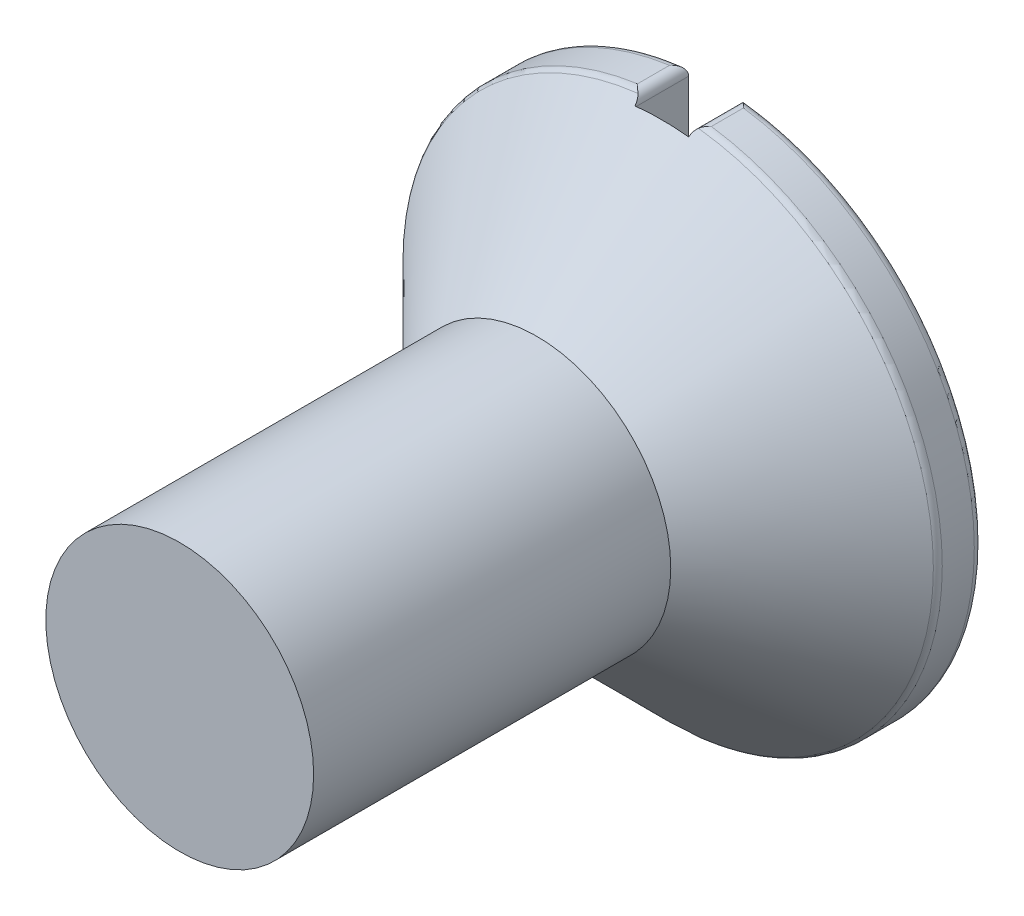
ISO-10303-21;
HEADER;
FILE_DESCRIPTION(('STEP AP214'),'2;1');
FILE_NAME('part.step','',(''),(''),'','','');
FILE_SCHEMA(('AUTOMOTIVE_DESIGN { 1 0 10303 214 1 1 1 1 }'));
ENDSEC;
DATA;
#1=APPLICATION_CONTEXT('core data for automotive mechanical design processes');
#2=APPLICATION_PROTOCOL_DEFINITION('international standard','automotive_design',2000,#1);
#3=PRODUCT_CONTEXT('',#1,'mechanical');
#4=PRODUCT('Part','Part','',(#3));
#5=PRODUCT_RELATED_PRODUCT_CATEGORY('part','',(#4));
#6=PRODUCT_DEFINITION_FORMATION('','',#4);
#7=PRODUCT_DEFINITION_CONTEXT('part definition',#1,'design');
#8=PRODUCT_DEFINITION('design','',#6,#7);
#9=PRODUCT_DEFINITION_SHAPE('','',#8);
#10=(LENGTH_UNIT() NAMED_UNIT(*) SI_UNIT(.MILLI.,.METRE.));
#11=(NAMED_UNIT(*) PLANE_ANGLE_UNIT() SI_UNIT($,.RADIAN.));
#12=(NAMED_UNIT(*) SI_UNIT($,.STERADIAN.) SOLID_ANGLE_UNIT());
#13=UNCERTAINTY_MEASURE_WITH_UNIT(LENGTH_MEASURE(1.E-05),#10,'distance_accuracy_value','');
#14=(GEOMETRIC_REPRESENTATION_CONTEXT(3) GLOBAL_UNCERTAINTY_ASSIGNED_CONTEXT((#13)) GLOBAL_UNIT_ASSIGNED_CONTEXT((#10,
#11,#12)) REPRESENTATION_CONTEXT('',''));
#15=CARTESIAN_POINT('',(0.,0.,0.));
#16=DIRECTION('',(0.,0.,1.));
#17=DIRECTION('',(1.,0.,0.));
#18=AXIS2_PLACEMENT_3D('',#15,#16,#17);
#19=CARTESIAN_POINT('',(0.,0.,0.));
#20=DIRECTION('',(0.,0.,-1.));
#21=DIRECTION('',(1.,0.,0.));
#22=AXIS2_PLACEMENT_3D('',#19,#20,#21);
#23=CONICAL_SURFACE('',#22,3.,0.78539816339745);
#24=CARTESIAN_POINT('',(0.,0.,0.0999999999999999));
#25=DIRECTION('',(0.,0.,-1.));
#26=DIRECTION('',(-1.,0.,0.));
#27=AXIS2_PLACEMENT_3D('',#24,#25,#26);
#28=CIRCLE('',#27,2.9);
#29=CARTESIAN_POINT('',(0.30073272659733,-2.8843647181231,0.0999999999999999));
#30=VERTEX_POINT('',#29);
#31=CARTESIAN_POINT('',(-0.300732726597331,-2.8843647181231,0.0999999999999999));
#32=VERTEX_POINT('',#31);
#33=EDGE_CURVE('E171',#30,#32,#28,.T.);
#34=ORIENTED_EDGE('',*,*,#33,.F.);
#35=CARTESIAN_POINT('',(0.30073272659733,-2.8843647181231,0.0999999999999999));
#36=CARTESIAN_POINT('',(0.301684783711957,-2.89206566258414,0.0922398695165193));
#37=CARTESIAN_POINT('',(0.303512139332086,-2.89969777176443,0.0844612827452677));
#38=CARTESIAN_POINT('',(0.308930839126989,-2.91430810945922,0.0693646726154849));
#39=CARTESIAN_POINT('',(0.312470438348838,-2.92129877286982,0.0620398414766648));
#40=CARTESIAN_POINT('',(0.319753628382327,-2.9321667859567,0.0504510048082696));
#41=CARTESIAN_POINT('',(0.322954779256334,-2.93625171193263,0.0460427199072146));
#42=CARTESIAN_POINT('',(0.330203894200469,-2.94409616155038,0.037445860466726));
#43=CARTESIAN_POINT('',(0.334266512358851,-2.94784821238044,0.0332629033433334));
#44=CARTESIAN_POINT('',(0.338755932738863,-2.95133297869326,0.0292893218813455));
#45=B_SPLINE_CURVE_WITH_KNOTS('',3,(#35,#36,#37,#38,#39,#40,#41,#42,#43,#44),.UNSPECIFIED.,.F.,
.F.,(4,2,2,2,4),(0.,0.0329529666263732,0.0649670028495592,0.0853370941347106,0.106086372365886),.UNSPECIFIED.);
#46=CARTESIAN_POINT('',(0.338755932738863,-2.95133297869326,0.0292893218813454));
#47=VERTEX_POINT('',#46);
#48=EDGE_CURVE('E213',#30,#47,#45,.T.);
#49=ORIENTED_EDGE('',*,*,#48,.T.);
#50=CARTESIAN_POINT('',(0.,0.,0.0292893218813454));
#51=DIRECTION('',(0.,0.,1.));
#52=DIRECTION('',(1.,0.,0.));
#53=AXIS2_PLACEMENT_3D('',#50,#51,#52);
#54=CIRCLE('',#53,2.97071067811865);
#55=CARTESIAN_POINT('',(0.338755932738864,2.95133297869326,0.0292893218813452));
#56=VERTEX_POINT('',#55);
#57=EDGE_CURVE('E226',#47,#56,#54,.T.);
#58=ORIENTED_EDGE('',*,*,#57,.T.);
#59=CARTESIAN_POINT('',(0.338755932738864,2.95133297869326,0.0292893218813452));
#60=CARTESIAN_POINT('',(0.333180758865674,2.94699716937392,0.034231542947922));
#61=CARTESIAN_POINT('',(0.328261384393389,2.94225903471712,0.0394879849822415));
#62=CARTESIAN_POINT('',(0.319751324033115,2.93230307698956,0.0503173876408015));
#63=CARTESIAN_POINT('',(0.316133888941695,2.92709803791381,0.0558808904040515));
#64=CARTESIAN_POINT('',(0.309759446915631,2.91588778851758,0.0677064441366709));
#65=CARTESIAN_POINT('',(0.307095958646677,2.90985191728549,0.0739885627357941));
#66=CARTESIAN_POINT('',(0.302968808043028,2.8973574369802,0.0868454382737013));
#67=CARTESIAN_POINT('',(0.301535720102118,2.89089213458808,0.0934235981812506));
#68=CARTESIAN_POINT('',(0.300732726597331,2.8843647181231,0.0999999999999998));
#69=B_SPLINE_CURVE_WITH_KNOTS('',3,(#59,#60,#61,#62,#63,#64,#65,#66,#67,#68),.UNSPECIFIED.,.F.,
.F.,(4,2,2,2,4),(0.,0.0257605348080804,0.0509566754392979,0.07819527083586,0.106092604834405),.UNSPECIFIED.);
#70=CARTESIAN_POINT('',(0.300732726597331,2.8843647181231,0.0999999999999999));
#71=VERTEX_POINT('',#70);
#72=EDGE_CURVE('E220',#56,#71,#69,.T.);
#73=ORIENTED_EDGE('',*,*,#72,.T.);
#74=CARTESIAN_POINT('',(-0.30073272659733,2.8843647181231,0.0999999999999999));
#75=VERTEX_POINT('',#74);
#76=EDGE_CURVE('E305',#75,#71,#28,.T.);
#77=ORIENTED_EDGE('',*,*,#76,.F.);
#78=CARTESIAN_POINT('',(-0.30073272659733,2.8843647181231,0.0999999999999999));
#79=CARTESIAN_POINT('',(-0.301684783711957,2.89206566258414,0.0922398695165193));
#80=CARTESIAN_POINT('',(-0.303512139332086,2.89969777176443,0.0844612827452677));
#81=CARTESIAN_POINT('',(-0.308930839126989,2.91430810945922,0.0693646726154849));
#82=CARTESIAN_POINT('',(-0.312470438348838,2.92129877286982,0.0620398414766648));
#83=CARTESIAN_POINT('',(-0.319753628382327,2.9321667859567,0.0504510048082696));
#84=CARTESIAN_POINT('',(-0.322954779256334,2.93625171193263,0.0460427199072146));
#85=CARTESIAN_POINT('',(-0.330203894200469,2.94409616155038,0.037445860466726));
#86=CARTESIAN_POINT('',(-0.334266512358851,2.94784821238044,0.0332629033433334));
#87=CARTESIAN_POINT('',(-0.338755932738863,2.95133297869326,0.0292893218813455));
#88=B_SPLINE_CURVE_WITH_KNOTS('',3,(#78,#79,#80,#81,#82,#83,#84,#85,#86,#87),.UNSPECIFIED.,.F.,
.F.,(4,2,2,2,4),(0.,0.0329529666263732,0.0649670028495592,0.0853370941347106,0.106086372365886),.UNSPECIFIED.);
#89=CARTESIAN_POINT('',(-0.338755932738863,2.95133297869326,0.0292893218813454));
#90=VERTEX_POINT('',#89);
#91=EDGE_CURVE('E187',#75,#90,#88,.T.);
#92=ORIENTED_EDGE('',*,*,#91,.T.);
#93=CARTESIAN_POINT('',(0.,0.,0.0292893218813454));
#94=DIRECTION('',(0.,0.,1.));
#95=DIRECTION('',(1.,0.,0.));
#96=AXIS2_PLACEMENT_3D('',#93,#94,#95);
#97=CIRCLE('',#96,2.97071067811865);
#98=CARTESIAN_POINT('',(-0.338755932738864,-2.95133297869326,0.0292893218813454));
#99=VERTEX_POINT('',#98);
#100=EDGE_CURVE('E185',#90,#99,#97,.T.);
#101=ORIENTED_EDGE('',*,*,#100,.T.);
#102=CARTESIAN_POINT('',(-0.338755932738864,-2.95133297869326,0.0292893218813452));
#103=CARTESIAN_POINT('',(-0.333180758865674,-2.94699716937392,0.034231542947922));
#104=CARTESIAN_POINT('',(-0.328261384393389,-2.94225903471712,0.0394879849822415));
#105=CARTESIAN_POINT('',(-0.319751324033115,-2.93230307698956,0.0503173876408015));
#106=CARTESIAN_POINT('',(-0.316133888941695,-2.92709803791381,0.0558808904040515));
#107=CARTESIAN_POINT('',(-0.309759446915631,-2.91588778851758,0.0677064441366709));
#108=CARTESIAN_POINT('',(-0.307095958646677,-2.90985191728549,0.0739885627357941));
#109=CARTESIAN_POINT('',(-0.302968808043028,-2.8973574369802,0.0868454382737013));
#110=CARTESIAN_POINT('',(-0.301535720102118,-2.89089213458808,0.0934235981812506));
#111=CARTESIAN_POINT('',(-0.300732726597331,-2.8843647181231,0.0999999999999998));
#112=B_SPLINE_CURVE_WITH_KNOTS('',3,(#102,#103,#104,#105,#106,#107,#108,#109,#110,#111),
.UNSPECIFIED.,.F.,.F.,(4,2,2,2,4),(0.,0.0257605348080804,0.0509566754392979,0.07819527083586,
0.106092604834405),.UNSPECIFIED.);
#113=EDGE_CURVE('E193',#99,#32,#112,.T.);
#114=ORIENTED_EDGE('',*,*,#113,.T.);
#115=EDGE_LOOP('',(#34,#49,#58,#73,#77,#92,#101,#114));
#116=FACE_BOUND('',#115,.T.);
#117=CARTESIAN_POINT('',(0.,0.,1.5));
#118=DIRECTION('',(0.,0.,1.));
#119=DIRECTION('',(1.,0.,0.));
#120=AXIS2_PLACEMENT_3D('',#117,#118,#119);
#121=CIRCLE('',#120,1.5);
#122=CARTESIAN_POINT('',(1.5,0.,1.5));
#123=VERTEX_POINT('',#122);
#124=EDGE_CURVE('E249',#123,#123,#121,.T.);
#125=ORIENTED_EDGE('',*,*,#124,.F.);
#126=EDGE_LOOP('',(#125));
#127=FACE_BOUND('',#126,.T.);
#128=ADVANCED_FACE('F30',(#116,#127),#23,.T.);
#129=CARTESIAN_POINT('',(0.,0.,-0.5));
#130=DIRECTION('',(0.,0.,1.));
#131=DIRECTION('',(1.,0.,0.));
#132=AXIS2_PLACEMENT_3D('',#129,#130,#131);
#133=CYLINDRICAL_SURFACE('',#132,3.);
#134=DIRECTION('',(0.,0.,1.));
#135=VECTOR('',#134,1.);
#136=CARTESIAN_POINT('',(0.413793103448276,-2.97132550683002,-0.5));
#137=LINE('',#136,#135);
#138=CARTESIAN_POINT('',(0.413793103448275,-2.97132550683002,-0.0414213562373095));
#139=VERTEX_POINT('',#138);
#140=CARTESIAN_POINT('',(0.413793103448275,-2.97132550683002,-0.4));
#141=VERTEX_POINT('',#140);
#142=EDGE_CURVE('E180',#139,#141,#137,.F.);
#143=ORIENTED_EDGE('',*,*,#142,.T.);
#144=CARTESIAN_POINT('',(0.,0.,-0.4));
#145=DIRECTION('',(0.,0.,-1.));
#146=DIRECTION('',(-1.,0.,0.));
#147=AXIS2_PLACEMENT_3D('',#144,#145,#146);
#148=CIRCLE('',#147,3.);
#149=CARTESIAN_POINT('',(0.413793103448276,2.97132550683002,-0.4));
#150=VERTEX_POINT('',#149);
#151=EDGE_CURVE('E149',#141,#150,#148,.F.);
#152=ORIENTED_EDGE('',*,*,#151,.T.);
#153=DIRECTION('',(0.,0.,1.));
#154=VECTOR('',#153,1.);
#155=CARTESIAN_POINT('',(0.413793103448276,2.97132550683002,-0.5));
#156=LINE('',#155,#154);
#157=CARTESIAN_POINT('',(0.413793103448276,2.97132550683002,-0.0414213562373095));
#158=VERTEX_POINT('',#157);
#159=EDGE_CURVE('E176',#150,#158,#156,.T.);
#160=ORIENTED_EDGE('',*,*,#159,.T.);
#161=CARTESIAN_POINT('',(0.,0.,-0.0414213562373095));
#162=DIRECTION('',(0.,0.,1.));
#163=DIRECTION('',(1.,0.,0.));
#164=AXIS2_PLACEMENT_3D('',#161,#162,#163);
#165=CIRCLE('',#164,3.);
#166=EDGE_CURVE('E178',#158,#139,#165,.F.);
#167=ORIENTED_EDGE('',*,*,#166,.T.);
#168=EDGE_LOOP('',(#143,#152,#160,#167));
#169=FACE_BOUND('',#168,.T.);
#170=ADVANCED_FACE('F203',(#169),#133,.T.);
#171=CARTESIAN_POINT('',(0.,0.,-0.4));
#172=DIRECTION('',(0.,0.,-1.));
#173=DIRECTION('',(-1.,0.,0.));
#174=AXIS2_PLACEMENT_3D('',#171,#172,#173);
#175=CIRCLE('',#174,3.);
#176=CARTESIAN_POINT('',(-0.413793103448275,2.97132550683002,-0.4));
#177=VERTEX_POINT('',#176);
#178=CARTESIAN_POINT('',(-0.413793103448276,-2.97132550683002,-0.4));
#179=VERTEX_POINT('',#178);
#180=EDGE_CURVE('E51',#177,#179,#175,.F.);
#181=ORIENTED_EDGE('',*,*,#180,.T.);
#182=DIRECTION('',(0.,0.,1.));
#183=VECTOR('',#182,1.);
#184=CARTESIAN_POINT('',(-0.413793103448276,-2.97132550683002,-0.5));
#185=LINE('',#184,#183);
#186=CARTESIAN_POINT('',(-0.413793103448276,-2.97132550683002,-0.0414213562373095));
#187=VERTEX_POINT('',#186);
#188=EDGE_CURVE('E298',#179,#187,#185,.T.);
#189=ORIENTED_EDGE('',*,*,#188,.T.);
#190=CARTESIAN_POINT('',(0.,0.,-0.0414213562373095));
#191=DIRECTION('',(0.,0.,1.));
#192=DIRECTION('',(1.,0.,0.));
#193=AXIS2_PLACEMENT_3D('',#190,#191,#192);
#194=CIRCLE('',#193,3.);
#195=CARTESIAN_POINT('',(-0.413793103448275,2.97132550683002,-0.0414213562373095));
#196=VERTEX_POINT('',#195);
#197=EDGE_CURVE('E288',#187,#196,#194,.F.);
#198=ORIENTED_EDGE('',*,*,#197,.T.);
#199=DIRECTION('',(0.,0.,1.));
#200=VECTOR('',#199,1.);
#201=CARTESIAN_POINT('',(-0.413793103448276,2.97132550683002,-0.5));
#202=LINE('',#201,#200);
#203=EDGE_CURVE('E56',#196,#177,#202,.F.);
#204=ORIENTED_EDGE('',*,*,#203,.T.);
#205=EDGE_LOOP('',(#181,#189,#198,#204));
#206=FACE_BOUND('',#205,.T.);
#207=ADVANCED_FACE('F205',(#206),#133,.T.);
#208=CARTESIAN_POINT('',(0.,0.,-0.5));
#209=DIRECTION('',(0.,0.,-1.));
#210=DIRECTION('',(-1.,0.,0.));
#211=AXIS2_PLACEMENT_3D('',#208,#209,#210);
#212=PLANE('',#211);
#213=CARTESIAN_POINT('',(0.,0.,-0.5));
#214=DIRECTION('',(0.,0.,-1.));
#215=DIRECTION('',(-1.,0.,0.));
#216=AXIS2_PLACEMENT_3D('',#213,#214,#215);
#217=CIRCLE('',#216,2.9);
#218=CARTESIAN_POINT('',(0.300732726597287,2.8843647181231,-0.5));
#219=VERTEX_POINT('',#218);
#220=CARTESIAN_POINT('',(0.300732726597287,-2.8843647181231,-0.5));
#221=VERTEX_POINT('',#220);
#222=EDGE_CURVE('E166',#219,#221,#217,.T.);
#223=ORIENTED_EDGE('',*,*,#222,.T.);
#224=CARTESIAN_POINT('',(0.4,-2.87228132326901,-0.5));
#225=DIRECTION('',(0.,0.,-1.));
#226=DIRECTION('',(-1.,0.,0.));
#227=AXIS2_PLACEMENT_3D('',#224,#225,#226);
#228=CIRCLE('',#227,0.1);
#229=CARTESIAN_POINT('',(0.3,-2.87228132326902,-0.5));
#230=VERTEX_POINT('',#229);
#231=EDGE_CURVE('E157',#221,#230,#228,.T.);
#232=ORIENTED_EDGE('',*,*,#231,.T.);
#233=DIRECTION('',(0.,-1.,0.));
#234=VECTOR('',#233,1.);
#235=CARTESIAN_POINT('',(0.3,2.98496231131986,-0.5));
#236=LINE('',#235,#234);
#237=CARTESIAN_POINT('',(0.3,2.87228132326901,-0.5));
#238=VERTEX_POINT('',#237);
#239=EDGE_CURVE('E141',#238,#230,#236,.T.);
#240=ORIENTED_EDGE('',*,*,#239,.F.);
#241=CARTESIAN_POINT('',(0.4,2.87228132326901,-0.5));
#242=DIRECTION('',(0.,0.,-1.));
#243=DIRECTION('',(-1.,0.,0.));
#244=AXIS2_PLACEMENT_3D('',#241,#242,#243);
#245=CIRCLE('',#244,0.1);
#246=EDGE_CURVE('E154',#238,#219,#245,.T.);
#247=ORIENTED_EDGE('',*,*,#246,.T.);
#248=EDGE_LOOP('',(#223,#232,#240,#247));
#249=FACE_BOUND('',#248,.T.);
#250=ADVANCED_FACE('F153',(#249),#212,.T.);
#251=DIRECTION('',(0.,1.,0.));
#252=VECTOR('',#251,1.);
#253=CARTESIAN_POINT('',(-0.3,2.98496231131986,-0.5));
#254=LINE('',#253,#252);
#255=CARTESIAN_POINT('',(-0.3,-2.87228132326901,-0.5));
#256=VERTEX_POINT('',#255);
#257=CARTESIAN_POINT('',(-0.3,2.87228132326901,-0.5));
#258=VERTEX_POINT('',#257);
#259=EDGE_CURVE('E158',#256,#258,#254,.T.);
#260=ORIENTED_EDGE('',*,*,#259,.F.);
#261=CARTESIAN_POINT('',(-0.4,-2.87228132326901,-0.5));
#262=DIRECTION('',(0.,0.,-1.));
#263=DIRECTION('',(-1.,0.,0.));
#264=AXIS2_PLACEMENT_3D('',#261,#262,#263);
#265=CIRCLE('',#264,0.1);
#266=CARTESIAN_POINT('',(-0.300732726597287,-2.8843647181231,-0.5));
#267=VERTEX_POINT('',#266);
#268=EDGE_CURVE('E319',#256,#267,#265,.T.);
#269=ORIENTED_EDGE('',*,*,#268,.T.);
#270=CARTESIAN_POINT('',(0.,0.,-0.5));
#271=DIRECTION('',(0.,0.,-1.));
#272=DIRECTION('',(-1.,0.,0.));
#273=AXIS2_PLACEMENT_3D('',#270,#271,#272);
#274=CIRCLE('',#273,2.9);
#275=CARTESIAN_POINT('',(-0.300732726597287,2.8843647181231,-0.5));
#276=VERTEX_POINT('',#275);
#277=EDGE_CURVE('E322',#267,#276,#274,.T.);
#278=ORIENTED_EDGE('',*,*,#277,.T.);
#279=CARTESIAN_POINT('',(-0.4,2.87228132326901,-0.5));
#280=DIRECTION('',(0.,0.,-1.));
#281=DIRECTION('',(-1.,0.,0.));
#282=AXIS2_PLACEMENT_3D('',#279,#280,#281);
#283=CIRCLE('',#282,0.1);
#284=EDGE_CURVE('E320',#276,#258,#283,.T.);
#285=ORIENTED_EDGE('',*,*,#284,.T.);
#286=EDGE_LOOP('',(#260,#269,#278,#285));
#287=FACE_BOUND('',#286,.T.);
#288=ADVANCED_FACE('F364',(#287),#212,.T.);
#289=CARTESIAN_POINT('',(0.,0.,5.5));
#290=DIRECTION('',(0.,0.,-1.));
#291=DIRECTION('',(-1.,0.,0.));
#292=AXIS2_PLACEMENT_3D('',#289,#290,#291);
#293=CYLINDRICAL_SURFACE('',#292,1.5);
#294=CARTESIAN_POINT('',(0.,0.,5.5));
#295=DIRECTION('',(0.,0.,1.));
#296=DIRECTION('',(1.,0.,0.));
#297=AXIS2_PLACEMENT_3D('',#294,#295,#296);
#298=CIRCLE('',#297,1.5);
#299=CARTESIAN_POINT('',(1.5,0.,5.5));
#300=VERTEX_POINT('',#299);
#301=EDGE_CURVE('E159',#300,#300,#298,.T.);
#302=ORIENTED_EDGE('',*,*,#301,.F.);
#303=EDGE_LOOP('',(#302));
#304=FACE_BOUND('',#303,.T.);
#305=ORIENTED_EDGE('',*,*,#124,.T.);
#306=EDGE_LOOP('',(#305));
#307=FACE_BOUND('',#306,.T.);
#308=ADVANCED_FACE('F361',(#304,#307),#293,.T.);
#309=CARTESIAN_POINT('',(0.,0.,5.5));
#310=DIRECTION('',(0.,0.,1.));
#311=DIRECTION('',(1.,0.,0.));
#312=AXIS2_PLACEMENT_3D('',#309,#310,#311);
#313=PLANE('',#312);
#314=ORIENTED_EDGE('',*,*,#301,.T.);
#315=EDGE_LOOP('',(#314));
#316=FACE_BOUND('',#315,.T.);
#317=ADVANCED_FACE('F363',(#316),#313,.T.);
#318=CARTESIAN_POINT('',(0.3,2.98496231131986,0.0999999999999999));
#319=DIRECTION('',(1.,0.,0.));
#320=DIRECTION('',(0.,1.,0.));
#321=AXIS2_PLACEMENT_3D('',#318,#319,#320);
#322=PLANE('',#321);
#323=ORIENTED_EDGE('',*,*,#239,.T.);
#324=DIRECTION('',(0.,0.,1.));
#325=VECTOR('',#324,1.);
#326=CARTESIAN_POINT('',(0.3,-2.87228132326901,0.0999999999999999));
#327=LINE('',#326,#325);
#328=CARTESIAN_POINT('',(0.3,-2.87228132326901,0.0999999999999999));
#329=VERTEX_POINT('',#328);
#330=EDGE_CURVE('E148',#230,#329,#327,.T.);
#331=ORIENTED_EDGE('',*,*,#330,.T.);
#332=DIRECTION('',(0.,-1.,0.));
#333=VECTOR('',#332,1.);
#334=CARTESIAN_POINT('',(0.3,2.98496231131986,0.0999999999999999));
#335=LINE('',#334,#333);
#336=CARTESIAN_POINT('',(0.3,2.87228132326901,0.0999999999999999));
#337=VERTEX_POINT('',#336);
#338=EDGE_CURVE('E144',#337,#329,#335,.T.);
#339=ORIENTED_EDGE('',*,*,#338,.F.);
#340=DIRECTION('',(0.,0.,1.));
#341=VECTOR('',#340,1.);
#342=CARTESIAN_POINT('',(0.3,2.87228132326901,0.0999999999999999));
#343=LINE('',#342,#341);
#344=EDGE_CURVE('E138',#337,#238,#343,.F.);
#345=ORIENTED_EDGE('',*,*,#344,.T.);
#346=EDGE_LOOP('',(#323,#331,#339,#345));
#347=FACE_BOUND('',#346,.T.);
#348=ADVANCED_FACE('F140',(#347),#322,.F.);
#349=CARTESIAN_POINT('',(-0.3,2.98496231131986,0.0999999999999999));
#350=DIRECTION('',(-1.,0.,0.));
#351=DIRECTION('',(0.,-1.,0.));
#352=AXIS2_PLACEMENT_3D('',#349,#350,#351);
#353=PLANE('',#352);
#354=DIRECTION('',(0.,1.,0.));
#355=VECTOR('',#354,1.);
#356=CARTESIAN_POINT('',(-0.3,2.98496231131986,0.0999999999999999));
#357=LINE('',#356,#355);
#358=CARTESIAN_POINT('',(-0.3,-2.87228132326901,0.0999999999999999));
#359=VERTEX_POINT('',#358);
#360=CARTESIAN_POINT('',(-0.3,2.87228132326901,0.0999999999999999));
#361=VERTEX_POINT('',#360);
#362=EDGE_CURVE('E167',#359,#361,#357,.T.);
#363=ORIENTED_EDGE('',*,*,#362,.F.);
#364=DIRECTION('',(0.,0.,1.));
#365=VECTOR('',#364,1.);
#366=CARTESIAN_POINT('',(-0.3,-2.87228132326901,0.0999999999999999));
#367=LINE('',#366,#365);
#368=EDGE_CURVE('E317',#359,#256,#367,.F.);
#369=ORIENTED_EDGE('',*,*,#368,.T.);
#370=ORIENTED_EDGE('',*,*,#259,.T.);
#371=DIRECTION('',(0.,0.,1.));
#372=VECTOR('',#371,1.);
#373=CARTESIAN_POINT('',(-0.3,2.87228132326901,0.0999999999999999));
#374=LINE('',#373,#372);
#375=EDGE_CURVE('E309',#258,#361,#374,.T.);
#376=ORIENTED_EDGE('',*,*,#375,.T.);
#377=EDGE_LOOP('',(#363,#369,#370,#376));
#378=FACE_BOUND('',#377,.T.);
#379=ADVANCED_FACE('F315',(#378),#353,.F.);
#380=CARTESIAN_POINT('',(0.3,-2.98496231131986,0.0999999999999999));
#381=DIRECTION('',(0.,0.,-1.));
#382=DIRECTION('',(-1.,0.,0.));
#383=AXIS2_PLACEMENT_3D('',#380,#381,#382);
#384=PLANE('',#383);
#385=ORIENTED_EDGE('',*,*,#76,.T.);
#386=CARTESIAN_POINT('',(0.4,2.87228132326901,0.0999999999999999));
#387=DIRECTION('',(0.,0.,-1.));
#388=DIRECTION('',(-1.,0.,0.));
#389=AXIS2_PLACEMENT_3D('',#386,#387,#388);
#390=CIRCLE('',#389,0.1);
#391=EDGE_CURVE('E333',#71,#337,#390,.F.);
#392=ORIENTED_EDGE('',*,*,#391,.T.);
#393=ORIENTED_EDGE('',*,*,#338,.T.);
#394=CARTESIAN_POINT('',(0.4,-2.87228132326901,0.0999999999999999));
#395=DIRECTION('',(0.,0.,-1.));
#396=DIRECTION('',(-1.,0.,0.));
#397=AXIS2_PLACEMENT_3D('',#394,#395,#396);
#398=CIRCLE('',#397,0.1);
#399=EDGE_CURVE('E331',#329,#30,#398,.F.);
#400=ORIENTED_EDGE('',*,*,#399,.T.);
#401=ORIENTED_EDGE('',*,*,#33,.T.);
#402=CARTESIAN_POINT('',(-0.4,-2.87228132326901,0.0999999999999999));
#403=DIRECTION('',(0.,0.,-1.));
#404=DIRECTION('',(-1.,0.,0.));
#405=AXIS2_PLACEMENT_3D('',#402,#403,#404);
#406=CIRCLE('',#405,0.1);
#407=EDGE_CURVE('E43',#32,#359,#406,.F.);
#408=ORIENTED_EDGE('',*,*,#407,.T.);
#409=ORIENTED_EDGE('',*,*,#362,.T.);
#410=CARTESIAN_POINT('',(-0.4,2.87228132326901,0.0999999999999999));
#411=DIRECTION('',(0.,0.,-1.));
#412=DIRECTION('',(-1.,0.,0.));
#413=AXIS2_PLACEMENT_3D('',#410,#411,#412);
#414=CIRCLE('',#413,0.1);
#415=EDGE_CURVE('E11',#361,#75,#414,.F.);
#416=ORIENTED_EDGE('',*,*,#415,.T.);
#417=EDGE_LOOP('',(#385,#392,#393,#400,#401,#408,#409,#416));
#418=FACE_BOUND('',#417,.T.);
#419=ADVANCED_FACE('F311',(#418),#384,.T.);
#420=CARTESIAN_POINT('',(0.,0.,-0.0414213562373095));
#421=DIRECTION('',(0.,0.,1.));
#422=DIRECTION('',(1.,0.,0.));
#423=AXIS2_PLACEMENT_3D('',#420,#421,#422);
#424=TOROIDAL_SURFACE('',#423,2.9,0.1);
#425=CARTESIAN_POINT('',(0.338755932738863,-2.95133297869326,0.0292893218813452));
#426=CARTESIAN_POINT('',(0.344290752838906,-2.95560471763261,0.024395772718149));
#427=CARTESIAN_POINT('',(0.350054053695164,-2.95916081391642,0.0192020745112917));
#428=CARTESIAN_POINT('',(0.361838860296018,-2.96494887215587,0.0084137999856691));
#429=CARTESIAN_POINT('',(0.367859630762714,-2.96718436580117,0.00282033813272477));
#430=CARTESIAN_POINT('',(0.380322192244367,-2.97054914182301,-0.00890672510133934));
#431=CARTESIAN_POINT('',(0.386769074534745,-2.97161166174165,-0.0150531585779399));
#432=CARTESIAN_POINT('',(0.399624622817242,-2.9724876195926,-0.0274660692623263));
#433=CARTESIAN_POINT('',(0.406033320502272,-2.97230230177989,-0.0337324206794066));
#434=CARTESIAN_POINT('',(0.41283487268603,-2.97145540676938,-0.0404706202755162));
#435=CARTESIAN_POINT('',(0.413314254380063,-2.97139218614474,-0.0409460130855262));
#436=CARTESIAN_POINT('',(0.413793103448275,-2.97132550683002,-0.0414213562373095));
#437=B_SPLINE_CURVE_WITH_KNOTS('',3,(#425,#426,#427,#428,#429,#430,#431,#432,#433,#434,#435,
#436),.UNSPECIFIED.,.F.,.F.,(4,2,2,2,2,4),(0.,0.0255093418727527,0.0509501515666793,
0.0777743556072114,0.104571816424114,0.106606034140977),.UNSPECIFIED.);
#438=EDGE_CURVE('E250',#139,#47,#437,.F.);
#439=ORIENTED_EDGE('',*,*,#438,.F.);
#440=ORIENTED_EDGE('',*,*,#166,.F.);
#441=CARTESIAN_POINT('',(0.338755932738864,2.95133297869326,0.0292893218813452));
#442=CARTESIAN_POINT('',(0.344290752838904,2.95560471763261,0.0243957727181467));
#443=CARTESIAN_POINT('',(0.350054053695163,2.95916081391642,0.0192020745112905));
#444=CARTESIAN_POINT('',(0.36183886029602,2.96494887215587,0.00841379998567005));
#445=CARTESIAN_POINT('',(0.367859630762717,2.96718436580117,0.00282033813272684));
#446=CARTESIAN_POINT('',(0.380322192244366,2.97054914182301,-0.00890672510134163));
#447=CARTESIAN_POINT('',(0.386769074534738,2.97161166174165,-0.015053158577948));
#448=CARTESIAN_POINT('',(0.399624622817252,2.9724876195926,-0.0274660692623169));
#449=CARTESIAN_POINT('',(0.406033320502305,2.97230230177989,-0.0337324206793739));
#450=CARTESIAN_POINT('',(0.412834872686035,2.97145540676938,-0.0404706202755114));
#451=CARTESIAN_POINT('',(0.413314254380067,2.97139218614474,-0.0409460130855237));
#452=CARTESIAN_POINT('',(0.413793103448276,2.97132550683002,-0.0414213562373095));
#453=B_SPLINE_CURVE_WITH_KNOTS('',3,(#441,#442,#443,#444,#445,#446,#447,#448,#449,#450,#451,
#452),.UNSPECIFIED.,.F.,.F.,(4,2,2,2,2,4),(0.,0.0255093418727526,0.0509501515666793,
0.0777743556072115,0.104571816424114,0.106606034140977),.UNSPECIFIED.);
#454=EDGE_CURVE('E244',#56,#158,#453,.T.);
#455=ORIENTED_EDGE('',*,*,#454,.F.);
#456=ORIENTED_EDGE('',*,*,#57,.F.);
#457=EDGE_LOOP('',(#439,#440,#455,#456));
#458=FACE_BOUND('',#457,.T.);
#459=ADVANCED_FACE('F230',(#458),#424,.T.);
#460=CARTESIAN_POINT('',(0.4,2.87228132326901,-0.5));
#461=DIRECTION('',(0.,0.,1.));
#462=DIRECTION('',(1.,0.,0.));
#463=AXIS2_PLACEMENT_3D('',#460,#461,#462);
#464=CYLINDRICAL_SURFACE('',#463,0.1);
#465=ORIENTED_EDGE('',*,*,#454,.T.);
#466=ORIENTED_EDGE('',*,*,#159,.F.);
#467=CARTESIAN_POINT('',(0.300732726597287,2.8843647181231,-0.5));
#468=CARTESIAN_POINT('',(0.301269856817648,2.88883967871245,-0.500007348194156));
#469=CARTESIAN_POINT('',(0.302122439130364,2.89326421377882,-0.499695889604641));
#470=CARTESIAN_POINT('',(0.304372349192562,2.90185277888712,-0.498504820905308));
#471=CARTESIAN_POINT('',(0.30576486250886,2.90601874390957,-0.497630188169162));
#472=CARTESIAN_POINT('',(0.309015839512633,2.91400124779568,-0.495383332338784));
#473=CARTESIAN_POINT('',(0.310872949509496,2.9178187585922,-0.494012549775121));
#474=CARTESIAN_POINT('',(0.314964884132728,2.92506753682074,-0.490858002666082));
#475=CARTESIAN_POINT('',(0.317200569404806,2.92849789381017,-0.489073293612039));
#476=CARTESIAN_POINT('',(0.322933562148815,2.93625448356295,-0.484378858408444));
#477=CARTESIAN_POINT('',(0.326573906211882,2.94037674730504,-0.481306947007225));
#478=CARTESIAN_POINT('',(0.334239991293601,2.94780772641218,-0.474698542338314));
#479=CARTESIAN_POINT('',(0.338266435544257,2.95111491657202,-0.471161196809421));
#480=CARTESIAN_POINT('',(0.348108707868005,2.9580470886128,-0.462386289176669));
#481=CARTESIAN_POINT('',(0.354033858216032,2.9613341687942,-0.457005089239761));
#482=CARTESIAN_POINT('',(0.366109876456102,2.96659416984865,-0.445873680480183));
#483=CARTESIAN_POINT('',(0.372260996491651,2.96856557257135,-0.440123053734004));
#484=CARTESIAN_POINT('',(0.384108736160476,2.9711807932193,-0.428905157552199));
#485=CARTESIAN_POINT('',(0.389800330008219,2.97192187493001,-0.423454428252414));
#486=CARTESIAN_POINT('',(0.401135173381902,2.97243525381933,-0.412477110557497));
#487=CARTESIAN_POINT('',(0.406778497214779,2.97220950017647,-0.40695069715841));
#488=CARTESIAN_POINT('',(0.412834866003856,2.97145540897426,-0.400950742804096));
#489=CARTESIAN_POINT('',(0.413314247613671,2.97139218856044,-0.40047535010704));
#490=CARTESIAN_POINT('',(0.413793103448276,2.97132550683002,-0.4));
#491=B_SPLINE_CURVE_WITH_KNOTS('',3,(#467,#468,#469,#470,#471,#472,#473,#474,#475,#476,#477,
#478,#479,#480,#481,#482,#483,#484,#485,#486,#487,#488,#489,#490),.UNSPECIFIED.,.F.,.F.,(4,2,2,
2,2,2,2,2,2,2,2,4),(0.,0.013480901575525,0.0268442635654032,0.0401691333357286,
0.0535247126123561,0.0723185136882654,0.0911472200783682,0.116966640543917,0.14281580256963,
0.166502530432606,0.190141527413174,0.192175745130037),.UNSPECIFIED.);
#492=EDGE_CURVE('E164',#219,#150,#491,.T.);
#493=ORIENTED_EDGE('',*,*,#492,.F.);
#494=ORIENTED_EDGE('',*,*,#246,.F.);
#495=ORIENTED_EDGE('',*,*,#344,.F.);
#496=ORIENTED_EDGE('',*,*,#391,.F.);
#497=ORIENTED_EDGE('',*,*,#72,.F.);
#498=EDGE_LOOP('',(#465,#466,#493,#494,#495,#496,#497));
#499=FACE_BOUND('',#498,.T.);
#500=ADVANCED_FACE('F162',(#499),#464,.T.);
#501=CARTESIAN_POINT('',(0.4,-2.87228132326901,-0.5));
#502=DIRECTION('',(0.,0.,1.));
#503=DIRECTION('',(1.,0.,0.));
#504=AXIS2_PLACEMENT_3D('',#501,#502,#503);
#505=CYLINDRICAL_SURFACE('',#504,0.1);
#506=ORIENTED_EDGE('',*,*,#330,.F.);
#507=ORIENTED_EDGE('',*,*,#231,.F.);
#508=CARTESIAN_POINT('',(0.300732726597287,-2.8843647181231,-0.5));
#509=CARTESIAN_POINT('',(0.301269856817648,-2.88883967871245,-0.500007348194156));
#510=CARTESIAN_POINT('',(0.302122439130363,-2.89326421377882,-0.499695889604641));
#511=CARTESIAN_POINT('',(0.304372349192562,-2.90185277888712,-0.498504820905308));
#512=CARTESIAN_POINT('',(0.30576486250886,-2.90601874390957,-0.497630188169162));
#513=CARTESIAN_POINT('',(0.309015839512632,-2.91400124779568,-0.495383332338784));
#514=CARTESIAN_POINT('',(0.310872949509495,-2.9178187585922,-0.49401254977512));
#515=CARTESIAN_POINT('',(0.314964884132728,-2.92506753682074,-0.490858002666082));
#516=CARTESIAN_POINT('',(0.317200569404806,-2.92849789381017,-0.489073293612039));
#517=CARTESIAN_POINT('',(0.322933562148814,-2.93625448356295,-0.484378858408444));
#518=CARTESIAN_POINT('',(0.326573906211882,-2.94037674730504,-0.481306947007225));
#519=CARTESIAN_POINT('',(0.3342399912936,-2.94780772641218,-0.474698542338314));
#520=CARTESIAN_POINT('',(0.338266435544256,-2.95111491657202,-0.471161196809421));
#521=CARTESIAN_POINT('',(0.348108707868004,-2.9580470886128,-0.462386289176669));
#522=CARTESIAN_POINT('',(0.354033858216031,-2.9613341687942,-0.457005089239761));
#523=CARTESIAN_POINT('',(0.366109876456102,-2.96659416984865,-0.445873680480184));
#524=CARTESIAN_POINT('',(0.372260996491654,-2.96856557257135,-0.440123053734007));
#525=CARTESIAN_POINT('',(0.384108736160473,-2.9711807932193,-0.428905157552197));
#526=CARTESIAN_POINT('',(0.389800330008209,-2.97192187493002,-0.423454428252405));
#527=CARTESIAN_POINT('',(0.401135173381912,-2.97243525381932,-0.412477110557509));
#528=CARTESIAN_POINT('',(0.406778497214816,-2.97220950017647,-0.406950697158449));
#529=CARTESIAN_POINT('',(0.412834866003862,-2.97145540897426,-0.400950742804102));
#530=CARTESIAN_POINT('',(0.413314247613673,-2.97139218856044,-0.400475350107044));
#531=CARTESIAN_POINT('',(0.413793103448275,-2.97132550683002,-0.4));
#532=B_SPLINE_CURVE_WITH_KNOTS('',3,(#508,#509,#510,#511,#512,#513,#514,#515,#516,#517,#518,
#519,#520,#521,#522,#523,#524,#525,#526,#527,#528,#529,#530,#531),.UNSPECIFIED.,.F.,.F.,(4,2,2,
2,2,2,2,2,2,2,2,4),(0.,0.013480901575525,0.0268442635654033,0.0401691333357282,
0.0535247126123562,0.0723185136882652,0.0911472200783677,0.116966640543916,0.142815802569629,
0.166502530432606,0.190141527413174,0.192175745130037),.UNSPECIFIED.);
#533=EDGE_CURVE('E290',#141,#221,#532,.F.);
#534=ORIENTED_EDGE('',*,*,#533,.F.);
#535=ORIENTED_EDGE('',*,*,#142,.F.);
#536=ORIENTED_EDGE('',*,*,#438,.T.);
#537=ORIENTED_EDGE('',*,*,#48,.F.);
#538=ORIENTED_EDGE('',*,*,#399,.F.);
#539=EDGE_LOOP('',(#506,#507,#534,#535,#536,#537,#538));
#540=FACE_BOUND('',#539,.T.);
#541=ADVANCED_FACE('F207',(#540),#505,.T.);
#542=CARTESIAN_POINT('',(0.,0.,-0.4));
#543=DIRECTION('',(0.,0.,-1.));
#544=DIRECTION('',(-1.,0.,0.));
#545=AXIS2_PLACEMENT_3D('',#542,#543,#544);
#546=TOROIDAL_SURFACE('',#545,2.9,0.1);
#547=ORIENTED_EDGE('',*,*,#492,.T.);
#548=ORIENTED_EDGE('',*,*,#151,.F.);
#549=ORIENTED_EDGE('',*,*,#533,.T.);
#550=ORIENTED_EDGE('',*,*,#222,.F.);
#551=EDGE_LOOP('',(#547,#548,#549,#550));
#552=FACE_BOUND('',#551,.T.);
#553=ADVANCED_FACE('F231',(#552),#546,.T.);
#554=CARTESIAN_POINT('',(-0.4,2.87228132326901,-0.5));
#555=DIRECTION('',(0.,0.,1.));
#556=DIRECTION('',(1.,0.,0.));
#557=AXIS2_PLACEMENT_3D('',#554,#555,#556);
#558=CYLINDRICAL_SURFACE('',#557,0.1);
#559=CARTESIAN_POINT('',(-0.300732726597287,2.8843647181231,-0.5));
#560=CARTESIAN_POINT('',(-0.301269856817648,2.88883967871245,-0.500007348194156));
#561=CARTESIAN_POINT('',(-0.302122439130363,2.89326421377882,-0.499695889604641));
#562=CARTESIAN_POINT('',(-0.304372349192562,2.90185277888712,-0.498504820905308));
#563=CARTESIAN_POINT('',(-0.30576486250886,2.90601874390957,-0.497630188169162));
#564=CARTESIAN_POINT('',(-0.309015839512632,2.91400124779568,-0.495383332338784));
#565=CARTESIAN_POINT('',(-0.310872949509495,2.9178187585922,-0.49401254977512));
#566=CARTESIAN_POINT('',(-0.314964884132728,2.92506753682074,-0.490858002666082));
#567=CARTESIAN_POINT('',(-0.317200569404806,2.92849789381017,-0.489073293612039));
#568=CARTESIAN_POINT('',(-0.322933562148814,2.93625448356295,-0.484378858408444));
#569=CARTESIAN_POINT('',(-0.326573906211882,2.94037674730504,-0.481306947007225));
#570=CARTESIAN_POINT('',(-0.3342399912936,2.94780772641218,-0.474698542338314));
#571=CARTESIAN_POINT('',(-0.338266435544256,2.95111491657202,-0.471161196809421));
#572=CARTESIAN_POINT('',(-0.348108707868004,2.9580470886128,-0.462386289176669));
#573=CARTESIAN_POINT('',(-0.354033858216031,2.9613341687942,-0.457005089239761));
#574=CARTESIAN_POINT('',(-0.366109876456102,2.96659416984865,-0.445873680480184));
#575=CARTESIAN_POINT('',(-0.372260996491654,2.96856557257135,-0.440123053734007));
#576=CARTESIAN_POINT('',(-0.384108736160473,2.9711807932193,-0.428905157552197));
#577=CARTESIAN_POINT('',(-0.389800330008209,2.97192187493002,-0.423454428252405));
#578=CARTESIAN_POINT('',(-0.401135173381912,2.97243525381932,-0.412477110557509));
#579=CARTESIAN_POINT('',(-0.406778497214816,2.97220950017647,-0.406950697158449));
#580=CARTESIAN_POINT('',(-0.412834866003862,2.97145540897426,-0.400950742804102));
#581=CARTESIAN_POINT('',(-0.413314247613673,2.97139218856044,-0.400475350107044));
#582=CARTESIAN_POINT('',(-0.413793103448275,2.97132550683002,-0.4));
#583=B_SPLINE_CURVE_WITH_KNOTS('',3,(#559,#560,#561,#562,#563,#564,#565,#566,#567,#568,#569,
#570,#571,#572,#573,#574,#575,#576,#577,#578,#579,#580,#581,#582),.UNSPECIFIED.,.F.,.F.,(4,2,2,
2,2,2,2,2,2,2,2,4),(0.,0.013480901575525,0.0268442635654033,0.0401691333357282,
0.0535247126123562,0.0723185136882652,0.0911472200783677,0.116966640543916,0.142815802569629,
0.166502530432606,0.190141527413174,0.192175745130037),.UNSPECIFIED.);
#584=EDGE_CURVE('E291',#177,#276,#583,.F.);
#585=ORIENTED_EDGE('',*,*,#584,.F.);
#586=ORIENTED_EDGE('',*,*,#203,.F.);
#587=CARTESIAN_POINT('',(-0.338755932738863,2.95133297869326,0.0292893218813452));
#588=CARTESIAN_POINT('',(-0.344290752838906,2.95560471763261,0.024395772718149));
#589=CARTESIAN_POINT('',(-0.350054053695164,2.95916081391642,0.0192020745112917));
#590=CARTESIAN_POINT('',(-0.361838860296018,2.96494887215587,0.00841379998566908));
#591=CARTESIAN_POINT('',(-0.367859630762714,2.96718436580117,0.00282033813272474));
#592=CARTESIAN_POINT('',(-0.380322192244367,2.97054914182301,-0.00890672510133938));
#593=CARTESIAN_POINT('',(-0.386769074534745,2.97161166174165,-0.0150531585779399));
#594=CARTESIAN_POINT('',(-0.399624622817242,2.9724876195926,-0.0274660692623263));
#595=CARTESIAN_POINT('',(-0.406033320502272,2.97230230177989,-0.0337324206794066));
#596=CARTESIAN_POINT('',(-0.41283487268603,2.97145540676938,-0.0404706202755162));
#597=CARTESIAN_POINT('',(-0.413314254380063,2.97139218614474,-0.0409460130855262));
#598=CARTESIAN_POINT('',(-0.413793103448275,2.97132550683002,-0.0414213562373095));
#599=B_SPLINE_CURVE_WITH_KNOTS('',3,(#587,#588,#589,#590,#591,#592,#593,#594,#595,#596,#597,
#598),.UNSPECIFIED.,.F.,.F.,(4,2,2,2,2,4),(0.,0.0255093418727527,0.0509501515666793,
0.0777743556072115,0.104571816424114,0.106606034140977),.UNSPECIFIED.);
#600=EDGE_CURVE('E35',#90,#196,#599,.T.);
#601=ORIENTED_EDGE('',*,*,#600,.F.);
#602=ORIENTED_EDGE('',*,*,#91,.F.);
#603=ORIENTED_EDGE('',*,*,#415,.F.);
#604=ORIENTED_EDGE('',*,*,#375,.F.);
#605=ORIENTED_EDGE('',*,*,#284,.F.);
#606=EDGE_LOOP('',(#585,#586,#601,#602,#603,#604,#605));
#607=FACE_BOUND('',#606,.T.);
#608=ADVANCED_FACE('F32',(#607),#558,.T.);
#609=CARTESIAN_POINT('',(0.,0.,-0.0414213562373095));
#610=DIRECTION('',(0.,0.,1.));
#611=DIRECTION('',(1.,0.,0.));
#612=AXIS2_PLACEMENT_3D('',#609,#610,#611);
#613=TOROIDAL_SURFACE('',#612,2.9,0.1);
#614=ORIENTED_EDGE('',*,*,#600,.T.);
#615=ORIENTED_EDGE('',*,*,#197,.F.);
#616=CARTESIAN_POINT('',(-0.338755932738864,-2.95133297869326,0.0292893218813452));
#617=CARTESIAN_POINT('',(-0.344290752838904,-2.95560471763261,0.0243957727181467));
#618=CARTESIAN_POINT('',(-0.350054053695163,-2.95916081391642,0.0192020745112905));
#619=CARTESIAN_POINT('',(-0.36183886029602,-2.96494887215587,0.00841379998567005));
#620=CARTESIAN_POINT('',(-0.367859630762717,-2.96718436580117,0.00282033813272684));
#621=CARTESIAN_POINT('',(-0.380322192244366,-2.97054914182301,-0.00890672510134163));
#622=CARTESIAN_POINT('',(-0.386769074534738,-2.97161166174165,-0.015053158577948));
#623=CARTESIAN_POINT('',(-0.399624622817252,-2.9724876195926,-0.0274660692623169));
#624=CARTESIAN_POINT('',(-0.406033320502305,-2.97230230177989,-0.0337324206793739));
#625=CARTESIAN_POINT('',(-0.412834872686035,-2.97145540676938,-0.0404706202755114));
#626=CARTESIAN_POINT('',(-0.413314254380067,-2.97139218614474,-0.0409460130855237));
#627=CARTESIAN_POINT('',(-0.413793103448276,-2.97132550683002,-0.0414213562373095));
#628=B_SPLINE_CURVE_WITH_KNOTS('',3,(#616,#617,#618,#619,#620,#621,#622,#623,#624,#625,#626,
#627),.UNSPECIFIED.,.F.,.F.,(4,2,2,2,2,4),(0.,0.0255093418727526,0.0509501515666793,
0.0777743556072115,0.104571816424114,0.106606034140977),.UNSPECIFIED.);
#629=EDGE_CURVE('E260',#99,#187,#628,.T.);
#630=ORIENTED_EDGE('',*,*,#629,.F.);
#631=ORIENTED_EDGE('',*,*,#100,.F.);
#632=EDGE_LOOP('',(#614,#615,#630,#631));
#633=FACE_BOUND('',#632,.T.);
#634=ADVANCED_FACE('F270',(#633),#613,.T.);
#635=CARTESIAN_POINT('',(0.,0.,-0.4));
#636=DIRECTION('',(0.,0.,-1.));
#637=DIRECTION('',(-1.,0.,0.));
#638=AXIS2_PLACEMENT_3D('',#635,#636,#637);
#639=TOROIDAL_SURFACE('',#638,2.9,0.1);
#640=ORIENTED_EDGE('',*,*,#584,.T.);
#641=ORIENTED_EDGE('',*,*,#277,.F.);
#642=CARTESIAN_POINT('',(-0.300732726597287,-2.8843647181231,-0.5));
#643=CARTESIAN_POINT('',(-0.301269856817648,-2.88883967871245,-0.500007348194156));
#644=CARTESIAN_POINT('',(-0.302122439130364,-2.89326421377882,-0.499695889604641));
#645=CARTESIAN_POINT('',(-0.304372349192562,-2.90185277888712,-0.498504820905308));
#646=CARTESIAN_POINT('',(-0.30576486250886,-2.90601874390957,-0.497630188169162));
#647=CARTESIAN_POINT('',(-0.309015839512633,-2.91400124779568,-0.495383332338784));
#648=CARTESIAN_POINT('',(-0.310872949509496,-2.9178187585922,-0.494012549775121));
#649=CARTESIAN_POINT('',(-0.314964884132728,-2.92506753682074,-0.490858002666082));
#650=CARTESIAN_POINT('',(-0.317200569404806,-2.92849789381017,-0.489073293612039));
#651=CARTESIAN_POINT('',(-0.322933562148815,-2.93625448356295,-0.484378858408444));
#652=CARTESIAN_POINT('',(-0.326573906211882,-2.94037674730504,-0.481306947007225));
#653=CARTESIAN_POINT('',(-0.334239991293601,-2.94780772641218,-0.474698542338314));
#654=CARTESIAN_POINT('',(-0.338266435544257,-2.95111491657202,-0.471161196809421));
#655=CARTESIAN_POINT('',(-0.348108707868005,-2.9580470886128,-0.462386289176669));
#656=CARTESIAN_POINT('',(-0.354033858216032,-2.9613341687942,-0.457005089239761));
#657=CARTESIAN_POINT('',(-0.366109876456102,-2.96659416984865,-0.445873680480183));
#658=CARTESIAN_POINT('',(-0.372260996491651,-2.96856557257135,-0.440123053734004));
#659=CARTESIAN_POINT('',(-0.384108736160476,-2.9711807932193,-0.428905157552199));
#660=CARTESIAN_POINT('',(-0.389800330008219,-2.97192187493001,-0.423454428252414));
#661=CARTESIAN_POINT('',(-0.401135173381902,-2.97243525381933,-0.412477110557497));
#662=CARTESIAN_POINT('',(-0.406778497214779,-2.97220950017647,-0.40695069715841));
#663=CARTESIAN_POINT('',(-0.412834866003856,-2.97145540897426,-0.400950742804096));
#664=CARTESIAN_POINT('',(-0.413314247613671,-2.97139218856044,-0.40047535010704));
#665=CARTESIAN_POINT('',(-0.413793103448276,-2.97132550683002,-0.4));
#666=B_SPLINE_CURVE_WITH_KNOTS('',3,(#642,#643,#644,#645,#646,#647,#648,#649,#650,#651,#652,
#653,#654,#655,#656,#657,#658,#659,#660,#661,#662,#663,#664,#665),.UNSPECIFIED.,.F.,.F.,(4,2,2,
2,2,2,2,2,2,2,2,4),(0.,0.013480901575525,0.0268442635654032,0.0401691333357286,
0.0535247126123561,0.0723185136882654,0.0911472200783682,0.116966640543917,0.14281580256963,
0.166502530432606,0.190141527413174,0.192175745130037),.UNSPECIFIED.);
#667=EDGE_CURVE('E254',#179,#267,#666,.F.);
#668=ORIENTED_EDGE('',*,*,#667,.F.);
#669=ORIENTED_EDGE('',*,*,#180,.F.);
#670=EDGE_LOOP('',(#640,#641,#668,#669));
#671=FACE_BOUND('',#670,.T.);
#672=ADVANCED_FACE('F264',(#671),#639,.T.);
#673=CARTESIAN_POINT('',(-0.4,-2.87228132326901,-0.5));
#674=DIRECTION('',(0.,0.,1.));
#675=DIRECTION('',(1.,0.,0.));
#676=AXIS2_PLACEMENT_3D('',#673,#674,#675);
#677=CYLINDRICAL_SURFACE('',#676,0.1);
#678=ORIENTED_EDGE('',*,*,#629,.T.);
#679=ORIENTED_EDGE('',*,*,#188,.F.);
#680=ORIENTED_EDGE('',*,*,#667,.T.);
#681=ORIENTED_EDGE('',*,*,#268,.F.);
#682=ORIENTED_EDGE('',*,*,#368,.F.);
#683=ORIENTED_EDGE('',*,*,#407,.F.);
#684=ORIENTED_EDGE('',*,*,#113,.F.);
#685=EDGE_LOOP('',(#678,#679,#680,#681,#682,#683,#684));
#686=FACE_BOUND('',#685,.T.);
#687=ADVANCED_FACE('F266',(#686),#677,.T.);
#688=CLOSED_SHELL('',(#128,#170,#207,#250,#288,#308,#317,#348,#379,#419,#459,#500,#541,#553,
#608,#634,#672,#687));
#689=MANIFOLD_SOLID_BREP('B2',#688);
#690=ADVANCED_BREP_SHAPE_REPRESENTATION('',(#18,#689),#14);
#691=SHAPE_DEFINITION_REPRESENTATION(#9,#690);
ENDSEC;
END-ISO-10303-21;
